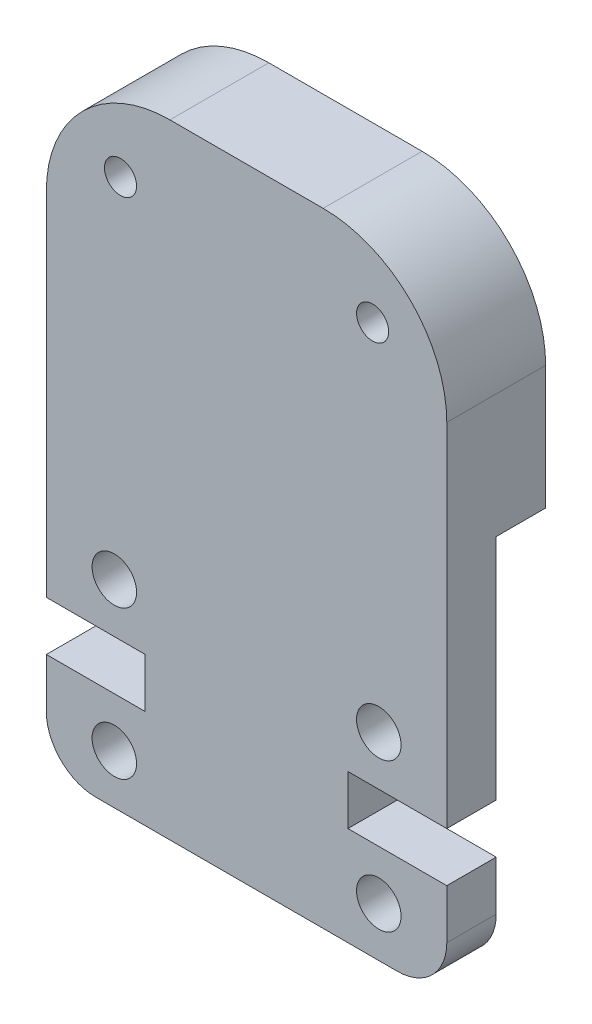
ISO-10303-21;
HEADER;
FILE_DESCRIPTION(('STEP AP214'),'2;1');
FILE_NAME('part.step','',(''),(''),'','','');
FILE_SCHEMA(('AUTOMOTIVE_DESIGN { 1 0 10303 214 1 1 1 1 }'));
ENDSEC;
DATA;
#1=APPLICATION_CONTEXT('core data for automotive mechanical design processes');
#2=APPLICATION_PROTOCOL_DEFINITION('international standard','automotive_design',2000,#1);
#3=PRODUCT_CONTEXT('',#1,'mechanical');
#4=PRODUCT('Part','Part','',(#3));
#5=PRODUCT_RELATED_PRODUCT_CATEGORY('part','',(#4));
#6=PRODUCT_DEFINITION_FORMATION('','',#4);
#7=PRODUCT_DEFINITION_CONTEXT('part definition',#1,'design');
#8=PRODUCT_DEFINITION('design','',#6,#7);
#9=PRODUCT_DEFINITION_SHAPE('','',#8);
#10=(LENGTH_UNIT() NAMED_UNIT(*) SI_UNIT(.MILLI.,.METRE.));
#11=(NAMED_UNIT(*) PLANE_ANGLE_UNIT() SI_UNIT($,.RADIAN.));
#12=(NAMED_UNIT(*) SI_UNIT($,.STERADIAN.) SOLID_ANGLE_UNIT());
#13=UNCERTAINTY_MEASURE_WITH_UNIT(LENGTH_MEASURE(1.E-05),#10,'distance_accuracy_value','');
#14=(GEOMETRIC_REPRESENTATION_CONTEXT(3) GLOBAL_UNCERTAINTY_ASSIGNED_CONTEXT((#13)) GLOBAL_UNIT_ASSIGNED_CONTEXT((#10,
#11,#12)) REPRESENTATION_CONTEXT('',''));
#15=CARTESIAN_POINT('',(0.,0.,0.));
#16=DIRECTION('',(0.,0.,1.));
#17=DIRECTION('',(1.,0.,0.));
#18=AXIS2_PLACEMENT_3D('',#15,#16,#17);
#19=CARTESIAN_POINT('',(14.2,2.00000000000002,0.));
#20=DIRECTION('',(0.,0.,-1.));
#21=DIRECTION('',(-1.,0.,0.));
#22=AXIS2_PLACEMENT_3D('',#19,#20,#21);
#23=PLANE('',#22);
#24=CARTESIAN_POINT('',(13.1999999999968,22.2299999999968,0.));
#25=DIRECTION('',(0.,0.,1.));
#26=DIRECTION('',(-1.,0.,0.));
#27=AXIS2_PLACEMENT_3D('',#24,#25,#26);
#28=CIRCLE('',#27,0.649999999999999);
#29=CARTESIAN_POINT('',(12.5499999999968,22.2299999999968,0.));
#30=VERTEX_POINT('',#29);
#31=EDGE_CURVE('E282',#30,#30,#28,.T.);
#32=ORIENTED_EDGE('',*,*,#31,.T.);
#33=EDGE_LOOP('',(#32));
#34=FACE_BOUND('',#33,.T.);
#35=CARTESIAN_POINT('',(3.00000000000323,22.2299999999968,0.));
#36=DIRECTION('',(0.,0.,1.));
#37=DIRECTION('',(1.,0.,0.));
#38=AXIS2_PLACEMENT_3D('',#35,#36,#37);
#39=CIRCLE('',#38,0.65);
#40=CARTESIAN_POINT('',(3.65000000000323,22.2299999999968,0.));
#41=VERTEX_POINT('',#40);
#42=EDGE_CURVE('E270',#41,#41,#39,.T.);
#43=ORIENTED_EDGE('',*,*,#42,.T.);
#44=EDGE_LOOP('',(#43));
#45=FACE_BOUND('',#44,.T.);
#46=DIRECTION('',(0.,1.,0.));
#47=VECTOR('',#46,1.);
#48=CARTESIAN_POINT('',(16.2,20.23,0.));
#49=LINE('',#48,#47);
#50=CARTESIAN_POINT('',(16.2,15.23,0.));
#51=VERTEX_POINT('',#50);
#52=CARTESIAN_POINT('',(16.2,20.23,0.));
#53=VERTEX_POINT('',#52);
#54=EDGE_CURVE('E159',#51,#53,#49,.T.);
#55=ORIENTED_EDGE('',*,*,#54,.F.);
#56=DIRECTION('',(-1.,0.,0.));
#57=VECTOR('',#56,1.);
#58=CARTESIAN_POINT('',(16.2,15.23,0.));
#59=LINE('',#58,#57);
#60=CARTESIAN_POINT('',(0.,15.23,0.));
#61=VERTEX_POINT('',#60);
#62=EDGE_CURVE('E231',#51,#61,#59,.T.);
#63=ORIENTED_EDGE('',*,*,#62,.T.);
#64=DIRECTION('',(0.,-1.,0.));
#65=VECTOR('',#64,1.);
#66=CARTESIAN_POINT('',(0.,20.23,0.));
#67=LINE('',#66,#65);
#68=CARTESIAN_POINT('',(0.,20.23,0.));
#69=VERTEX_POINT('',#68);
#70=EDGE_CURVE('E167',#69,#61,#67,.T.);
#71=ORIENTED_EDGE('',*,*,#70,.F.);
#72=CARTESIAN_POINT('',(5.00000000000002,20.23,0.));
#73=DIRECTION('',(0.,0.,1.));
#74=DIRECTION('',(1.,0.,0.));
#75=AXIS2_PLACEMENT_3D('',#72,#73,#74);
#76=CIRCLE('',#75,5.00000000000002);
#77=CARTESIAN_POINT('',(5.00000000000002,25.23,0.));
#78=VERTEX_POINT('',#77);
#79=EDGE_CURVE('E80',#78,#69,#76,.T.);
#80=ORIENTED_EDGE('',*,*,#79,.F.);
#81=DIRECTION('',(-1.,0.,0.));
#82=VECTOR('',#81,1.);
#83=CARTESIAN_POINT('',(5.00000000000002,25.23,0.));
#84=LINE('',#83,#82);
#85=CARTESIAN_POINT('',(11.2,25.23,0.));
#86=VERTEX_POINT('',#85);
#87=EDGE_CURVE('E164',#86,#78,#84,.T.);
#88=ORIENTED_EDGE('',*,*,#87,.F.);
#89=CARTESIAN_POINT('',(11.2,20.23,0.));
#90=DIRECTION('',(0.,0.,1.));
#91=DIRECTION('',(-1.,0.,0.));
#92=AXIS2_PLACEMENT_3D('',#89,#90,#91);
#93=CIRCLE('',#92,5.00000000000002);
#94=EDGE_CURVE('E161',#53,#86,#93,.T.);
#95=ORIENTED_EDGE('',*,*,#94,.F.);
#96=EDGE_LOOP('',(#55,#63,#71,#80,#88,#95));
#97=FACE_BOUND('',#96,.T.);
#98=ADVANCED_FACE('F33',(#34,#45,#97),#23,.T.);
#99=CARTESIAN_POINT('',(16.2,20.23,4.));
#100=DIRECTION('',(-1.,0.,0.));
#101=DIRECTION('',(0.,-1.,0.));
#102=AXIS2_PLACEMENT_3D('',#99,#100,#101);
#103=PLANE('',#102);
#104=DIRECTION('',(0.,0.,-1.));
#105=VECTOR('',#104,1.);
#106=CARTESIAN_POINT('',(16.2,15.23,2.));
#107=LINE('',#106,#105);
#108=CARTESIAN_POINT('',(16.2,15.23,2.));
#109=VERTEX_POINT('',#108);
#110=EDGE_CURVE('E236',#109,#51,#107,.T.);
#111=ORIENTED_EDGE('',*,*,#110,.T.);
#112=ORIENTED_EDGE('',*,*,#54,.T.);
#113=DIRECTION('',(0.,0.,-1.));
#114=VECTOR('',#113,1.);
#115=CARTESIAN_POINT('',(16.2,20.23,4.));
#116=LINE('',#115,#114);
#117=CARTESIAN_POINT('',(16.2,20.23,4.));
#118=VERTEX_POINT('',#117);
#119=EDGE_CURVE('E191',#118,#53,#116,.T.);
#120=ORIENTED_EDGE('',*,*,#119,.F.);
#121=DIRECTION('',(0.,1.,0.));
#122=VECTOR('',#121,1.);
#123=CARTESIAN_POINT('',(16.2,20.23,4.));
#124=LINE('',#123,#122);
#125=CARTESIAN_POINT('',(16.2,6.00000000000006,4.));
#126=VERTEX_POINT('',#125);
#127=EDGE_CURVE('E297',#126,#118,#124,.T.);
#128=ORIENTED_EDGE('',*,*,#127,.F.);
#129=DIRECTION('',(0.,0.,-1.));
#130=VECTOR('',#129,1.);
#131=CARTESIAN_POINT('',(16.2,6.00000000000006,4.));
#132=LINE('',#131,#130);
#133=CARTESIAN_POINT('',(16.2,6.00000000000006,2.));
#134=VERTEX_POINT('',#133);
#135=EDGE_CURVE('E194',#126,#134,#132,.T.);
#136=ORIENTED_EDGE('',*,*,#135,.T.);
#137=DIRECTION('',(0.,1.,0.));
#138=VECTOR('',#137,1.);
#139=CARTESIAN_POINT('',(16.2,0.,2.));
#140=LINE('',#139,#138);
#141=EDGE_CURVE('E221',#134,#109,#140,.T.);
#142=ORIENTED_EDGE('',*,*,#141,.T.);
#143=EDGE_LOOP('',(#111,#112,#120,#128,#136,#142));
#144=FACE_BOUND('',#143,.T.);
#145=ADVANCED_FACE('F379',(#144),#103,.F.);
#146=CARTESIAN_POINT('',(0.,20.23,4.));
#147=DIRECTION('',(1.,0.,0.));
#148=DIRECTION('',(0.,1.,0.));
#149=AXIS2_PLACEMENT_3D('',#146,#147,#148);
#150=PLANE('',#149);
#151=DIRECTION('',(0.,0.,-1.));
#152=VECTOR('',#151,1.);
#153=CARTESIAN_POINT('',(0.,15.23,2.));
#154=LINE('',#153,#152);
#155=CARTESIAN_POINT('',(0.,15.23,2.));
#156=VERTEX_POINT('',#155);
#157=EDGE_CURVE('E224',#156,#61,#154,.T.);
#158=ORIENTED_EDGE('',*,*,#157,.F.);
#159=DIRECTION('',(0.,-1.,0.));
#160=VECTOR('',#159,1.);
#161=CARTESIAN_POINT('',(0.,15.23,2.));
#162=LINE('',#161,#160);
#163=CARTESIAN_POINT('',(0.,6.00000000000004,2.));
#164=VERTEX_POINT('',#163);
#165=EDGE_CURVE('E356',#156,#164,#162,.T.);
#166=ORIENTED_EDGE('',*,*,#165,.T.);
#167=DIRECTION('',(0.,0.,-1.));
#168=VECTOR('',#167,1.);
#169=CARTESIAN_POINT('',(0.,6.00000000000003,4.));
#170=LINE('',#169,#168);
#171=CARTESIAN_POINT('',(0.,6.00000000000003,4.));
#172=VERTEX_POINT('',#171);
#173=EDGE_CURVE('E181',#172,#164,#170,.T.);
#174=ORIENTED_EDGE('',*,*,#173,.F.);
#175=DIRECTION('',(0.,-1.,0.));
#176=VECTOR('',#175,1.);
#177=CARTESIAN_POINT('',(0.,20.23,4.));
#178=LINE('',#177,#176);
#179=CARTESIAN_POINT('',(0.,20.23,4.));
#180=VERTEX_POINT('',#179);
#181=EDGE_CURVE('E305',#180,#172,#178,.T.);
#182=ORIENTED_EDGE('',*,*,#181,.F.);
#183=DIRECTION('',(0.,0.,-1.));
#184=VECTOR('',#183,1.);
#185=CARTESIAN_POINT('',(0.,20.23,4.));
#186=LINE('',#185,#184);
#187=EDGE_CURVE('E184',#180,#69,#186,.T.);
#188=ORIENTED_EDGE('',*,*,#187,.T.);
#189=ORIENTED_EDGE('',*,*,#70,.T.);
#190=EDGE_LOOP('',(#158,#166,#174,#182,#188,#189));
#191=FACE_BOUND('',#190,.T.);
#192=ADVANCED_FACE('F362',(#191),#150,.F.);
#193=CARTESIAN_POINT('',(14.2,2.00000000000002,4.));
#194=DIRECTION('',(0.,0.,-1.));
#195=DIRECTION('',(-1.,0.,0.));
#196=AXIS2_PLACEMENT_3D('',#193,#194,#195);
#197=PLANE('',#196);
#198=CARTESIAN_POINT('',(3.00000000000323,22.2299999999968,4.));
#199=DIRECTION('',(0.,0.,1.));
#200=DIRECTION('',(1.,0.,0.));
#201=AXIS2_PLACEMENT_3D('',#198,#199,#200);
#202=CIRCLE('',#201,0.65);
#203=CARTESIAN_POINT('',(3.65000000000323,22.2299999999968,4.));
#204=VERTEX_POINT('',#203);
#205=EDGE_CURVE('E271',#204,#204,#202,.T.);
#206=ORIENTED_EDGE('',*,*,#205,.F.);
#207=EDGE_LOOP('',(#206));
#208=FACE_BOUND('',#207,.T.);
#209=CARTESIAN_POINT('',(2.75000000000002,8.00000000000025,4.));
#210=DIRECTION('',(0.,0.,1.));
#211=DIRECTION('',(1.,0.,0.));
#212=AXIS2_PLACEMENT_3D('',#209,#210,#211);
#213=CIRCLE('',#212,0.9);
#214=CARTESIAN_POINT('',(3.65000000000002,8.00000000000025,4.));
#215=VERTEX_POINT('',#214);
#216=EDGE_CURVE('E279',#215,#215,#213,.T.);
#217=ORIENTED_EDGE('',*,*,#216,.F.);
#218=EDGE_LOOP('',(#217));
#219=FACE_BOUND('',#218,.T.);
#220=CARTESIAN_POINT('',(13.45,2.00000000000002,4.));
#221=DIRECTION('',(0.,0.,1.));
#222=DIRECTION('',(-1.,0.,0.));
#223=AXIS2_PLACEMENT_3D('',#220,#221,#222);
#224=CIRCLE('',#223,0.9);
#225=CARTESIAN_POINT('',(12.55,2.00000000000002,4.));
#226=VERTEX_POINT('',#225);
#227=EDGE_CURVE('E162',#226,#226,#224,.T.);
#228=ORIENTED_EDGE('',*,*,#227,.F.);
#229=EDGE_LOOP('',(#228));
#230=FACE_BOUND('',#229,.T.);
#231=CARTESIAN_POINT('',(14.2,2.00000000000002,4.));
#232=DIRECTION('',(0.,0.,1.));
#233=DIRECTION('',(-1.,0.,0.));
#234=AXIS2_PLACEMENT_3D('',#231,#232,#233);
#235=CIRCLE('',#234,2.00000000000002);
#236=CARTESIAN_POINT('',(14.2,0.,4.));
#237=VERTEX_POINT('',#236);
#238=CARTESIAN_POINT('',(16.2,2.00000000000002,4.));
#239=VERTEX_POINT('',#238);
#240=EDGE_CURVE('E170',#237,#239,#235,.T.);
#241=ORIENTED_EDGE('',*,*,#240,.T.);
#242=DIRECTION('',(0.,1.,0.));
#243=VECTOR('',#242,1.);
#244=CARTESIAN_POINT('',(16.2,2.00000000000002,4.));
#245=LINE('',#244,#243);
#246=CARTESIAN_POINT('',(16.2,4.00000000000001,4.));
#247=VERTEX_POINT('',#246);
#248=EDGE_CURVE('E88',#239,#247,#245,.T.);
#249=ORIENTED_EDGE('',*,*,#248,.T.);
#250=DIRECTION('',(-1.,0.,0.));
#251=VECTOR('',#250,1.);
#252=CARTESIAN_POINT('',(12.1999999999999,4.00000000000003,4.));
#253=LINE('',#252,#251);
#254=CARTESIAN_POINT('',(12.1999999999999,4.00000000000003,4.));
#255=VERTEX_POINT('',#254);
#256=EDGE_CURVE('E212',#247,#255,#253,.T.);
#257=ORIENTED_EDGE('',*,*,#256,.T.);
#258=DIRECTION('',(0.,1.,0.));
#259=VECTOR('',#258,1.);
#260=CARTESIAN_POINT('',(12.1999999999999,6.00000000000006,4.));
#261=LINE('',#260,#259);
#262=CARTESIAN_POINT('',(12.1999999999999,6.00000000000006,4.));
#263=VERTEX_POINT('',#262);
#264=EDGE_CURVE('E293',#255,#263,#261,.T.);
#265=ORIENTED_EDGE('',*,*,#264,.T.);
#266=DIRECTION('',(1.,0.,0.));
#267=VECTOR('',#266,1.);
#268=CARTESIAN_POINT('',(16.2,6.00000000000006,4.));
#269=LINE('',#268,#267);
#270=EDGE_CURVE('E295',#263,#126,#269,.T.);
#271=ORIENTED_EDGE('',*,*,#270,.T.);
#272=ORIENTED_EDGE('',*,*,#127,.T.);
#273=CARTESIAN_POINT('',(11.2,20.23,4.));
#274=DIRECTION('',(0.,0.,1.));
#275=DIRECTION('',(-1.,0.,0.));
#276=AXIS2_PLACEMENT_3D('',#273,#274,#275);
#277=CIRCLE('',#276,5.00000000000002);
#278=CARTESIAN_POINT('',(11.2,25.23,4.));
#279=VERTEX_POINT('',#278);
#280=EDGE_CURVE('E299',#118,#279,#277,.T.);
#281=ORIENTED_EDGE('',*,*,#280,.T.);
#282=DIRECTION('',(-1.,0.,0.));
#283=VECTOR('',#282,1.);
#284=CARTESIAN_POINT('',(5.00000000000002,25.23,4.));
#285=LINE('',#284,#283);
#286=CARTESIAN_POINT('',(5.00000000000002,25.23,4.));
#287=VERTEX_POINT('',#286);
#288=EDGE_CURVE('E301',#279,#287,#285,.T.);
#289=ORIENTED_EDGE('',*,*,#288,.T.);
#290=CARTESIAN_POINT('',(5.00000000000002,20.23,4.));
#291=DIRECTION('',(0.,0.,1.));
#292=DIRECTION('',(1.,0.,0.));
#293=AXIS2_PLACEMENT_3D('',#290,#291,#292);
#294=CIRCLE('',#293,5.00000000000002);
#295=EDGE_CURVE('E303',#287,#180,#294,.T.);
#296=ORIENTED_EDGE('',*,*,#295,.T.);
#297=ORIENTED_EDGE('',*,*,#181,.T.);
#298=DIRECTION('',(1.,0.,0.));
#299=VECTOR('',#298,1.);
#300=CARTESIAN_POINT('',(0.,6.00000000000003,4.));
#301=LINE('',#300,#299);
#302=CARTESIAN_POINT('',(4.00000000000004,6.00000000000003,4.));
#303=VERTEX_POINT('',#302);
#304=EDGE_CURVE('E307',#172,#303,#301,.T.);
#305=ORIENTED_EDGE('',*,*,#304,.T.);
#306=DIRECTION('',(0.,-1.,0.));
#307=VECTOR('',#306,1.);
#308=CARTESIAN_POINT('',(4.00000000000004,6.00000000000003,4.));
#309=LINE('',#308,#307);
#310=CARTESIAN_POINT('',(4.00000000000004,4.00000000000002,4.));
#311=VERTEX_POINT('',#310);
#312=EDGE_CURVE('E309',#303,#311,#309,.T.);
#313=ORIENTED_EDGE('',*,*,#312,.T.);
#314=DIRECTION('',(-1.,0.,0.));
#315=VECTOR('',#314,1.);
#316=CARTESIAN_POINT('',(4.00000000000004,4.00000000000002,4.));
#317=LINE('',#316,#315);
#318=CARTESIAN_POINT('',(0.,4.,4.));
#319=VERTEX_POINT('',#318);
#320=EDGE_CURVE('E135',#311,#319,#317,.T.);
#321=ORIENTED_EDGE('',*,*,#320,.T.);
#322=DIRECTION('',(0.,-1.,0.));
#323=VECTOR('',#322,1.);
#324=CARTESIAN_POINT('',(0.,2.00000000000003,4.));
#325=LINE('',#324,#323);
#326=CARTESIAN_POINT('',(0.,2.00000000000003,4.));
#327=VERTEX_POINT('',#326);
#328=EDGE_CURVE('E127',#319,#327,#325,.T.);
#329=ORIENTED_EDGE('',*,*,#328,.T.);
#330=CARTESIAN_POINT('',(2.00000000000001,2.00000000000003,4.));
#331=DIRECTION('',(0.,0.,1.));
#332=DIRECTION('',(1.,0.,0.));
#333=AXIS2_PLACEMENT_3D('',#330,#331,#332);
#334=CIRCLE('',#333,2.00000000000001);
#335=CARTESIAN_POINT('',(2.00000000000001,0.,4.));
#336=VERTEX_POINT('',#335);
#337=EDGE_CURVE('E132',#327,#336,#334,.T.);
#338=ORIENTED_EDGE('',*,*,#337,.T.);
#339=DIRECTION('',(1.,0.,0.));
#340=VECTOR('',#339,1.);
#341=CARTESIAN_POINT('',(2.00000000000001,0.,4.));
#342=LINE('',#341,#340);
#343=EDGE_CURVE('E58',#336,#237,#342,.T.);
#344=ORIENTED_EDGE('',*,*,#343,.T.);
#345=EDGE_LOOP('',(#241,#249,#257,#265,#271,#272,#281,#289,#296,#297,#305,#313,#321,#329,#338,#344));
#346=FACE_BOUND('',#345,.T.);
#347=CARTESIAN_POINT('',(13.1999999999968,22.2299999999968,4.));
#348=DIRECTION('',(0.,0.,1.));
#349=DIRECTION('',(-1.,0.,0.));
#350=AXIS2_PLACEMENT_3D('',#347,#348,#349);
#351=CIRCLE('',#350,0.649999999999999);
#352=CARTESIAN_POINT('',(12.5499999999968,22.2299999999968,4.));
#353=VERTEX_POINT('',#352);
#354=EDGE_CURVE('E283',#353,#353,#351,.T.);
#355=ORIENTED_EDGE('',*,*,#354,.F.);
#356=EDGE_LOOP('',(#355));
#357=FACE_BOUND('',#356,.T.);
#358=CARTESIAN_POINT('',(13.45,8.00000000000002,4.));
#359=DIRECTION('',(0.,0.,1.));
#360=DIRECTION('',(-1.,0.,0.));
#361=AXIS2_PLACEMENT_3D('',#358,#359,#360);
#362=CIRCLE('',#361,0.9);
#363=CARTESIAN_POINT('',(12.55,8.00000000000002,4.));
#364=VERTEX_POINT('',#363);
#365=EDGE_CURVE('E274',#364,#364,#362,.T.);
#366=ORIENTED_EDGE('',*,*,#365,.F.);
#367=EDGE_LOOP('',(#366));
#368=FACE_BOUND('',#367,.T.);
#369=CARTESIAN_POINT('',(2.75000000000002,2.00000000000025,4.));
#370=DIRECTION('',(0.,0.,1.));
#371=DIRECTION('',(1.,0.,0.));
#372=AXIS2_PLACEMENT_3D('',#369,#370,#371);
#373=CIRCLE('',#372,0.9);
#374=CARTESIAN_POINT('',(3.65000000000002,2.00000000000025,4.));
#375=VERTEX_POINT('',#374);
#376=EDGE_CURVE('E267',#375,#375,#373,.T.);
#377=ORIENTED_EDGE('',*,*,#376,.F.);
#378=EDGE_LOOP('',(#377));
#379=FACE_BOUND('',#378,.T.);
#380=ADVANCED_FACE('F129',(#208,#219,#230,#346,#357,#368,#379),#197,.F.);
#381=CARTESIAN_POINT('',(14.2,2.00000000000002,4.));
#382=DIRECTION('',(0.,0.,-1.));
#383=DIRECTION('',(-1.,0.,0.));
#384=AXIS2_PLACEMENT_3D('',#381,#382,#383);
#385=CYLINDRICAL_SURFACE('',#384,2.00000000000002);
#386=DIRECTION('',(0.,0.,-1.));
#387=VECTOR('',#386,1.);
#388=CARTESIAN_POINT('',(14.2,0.,4.));
#389=LINE('',#388,#387);
#390=CARTESIAN_POINT('',(14.2,0.,2.));
#391=VERTEX_POINT('',#390);
#392=EDGE_CURVE('E155',#237,#391,#389,.T.);
#393=ORIENTED_EDGE('',*,*,#392,.T.);
#394=CARTESIAN_POINT('',(14.2,2.00000000000002,2.));
#395=DIRECTION('',(0.,0.,1.));
#396=DIRECTION('',(1.,0.,0.));
#397=AXIS2_PLACEMENT_3D('',#394,#395,#396);
#398=CIRCLE('',#397,2.00000000000002);
#399=CARTESIAN_POINT('',(16.2,2.00000000000002,2.));
#400=VERTEX_POINT('',#399);
#401=EDGE_CURVE('E49',#391,#400,#398,.T.);
#402=ORIENTED_EDGE('',*,*,#401,.T.);
#403=DIRECTION('',(0.,0.,-1.));
#404=VECTOR('',#403,1.);
#405=CARTESIAN_POINT('',(16.2,2.00000000000002,4.));
#406=LINE('',#405,#404);
#407=EDGE_CURVE('E11',#239,#400,#406,.T.);
#408=ORIENTED_EDGE('',*,*,#407,.F.);
#409=ORIENTED_EDGE('',*,*,#240,.F.);
#410=EDGE_LOOP('',(#393,#402,#408,#409));
#411=FACE_BOUND('',#410,.T.);
#412=ADVANCED_FACE('F35',(#411),#385,.T.);
#413=CARTESIAN_POINT('',(16.2,2.00000000000002,4.));
#414=DIRECTION('',(-1.,0.,0.));
#415=DIRECTION('',(0.,-1.,0.));
#416=AXIS2_PLACEMENT_3D('',#413,#414,#415);
#417=PLANE('',#416);
#418=ORIENTED_EDGE('',*,*,#407,.T.);
#419=CARTESIAN_POINT('',(16.2,4.00000000000002,2.));
#420=VERTEX_POINT('',#419);
#421=EDGE_CURVE('E218',#400,#420,#140,.T.);
#422=ORIENTED_EDGE('',*,*,#421,.T.);
#423=DIRECTION('',(0.,0.,-1.));
#424=VECTOR('',#423,1.);
#425=CARTESIAN_POINT('',(16.2,4.00000000000001,4.));
#426=LINE('',#425,#424);
#427=EDGE_CURVE('E42',#247,#420,#426,.T.);
#428=ORIENTED_EDGE('',*,*,#427,.F.);
#429=ORIENTED_EDGE('',*,*,#248,.F.);
#430=EDGE_LOOP('',(#418,#422,#428,#429));
#431=FACE_BOUND('',#430,.T.);
#432=ADVANCED_FACE('F217',(#431),#417,.F.);
#433=CARTESIAN_POINT('',(12.1999999999999,4.00000000000003,4.));
#434=DIRECTION('',(0.,-1.,0.));
#435=DIRECTION('',(1.,0.,0.));
#436=AXIS2_PLACEMENT_3D('',#433,#434,#435);
#437=PLANE('',#436);
#438=ORIENTED_EDGE('',*,*,#427,.T.);
#439=DIRECTION('',(-1.,0.,0.));
#440=VECTOR('',#439,1.);
#441=CARTESIAN_POINT('',(12.1999999999999,4.00000000000003,2.));
#442=LINE('',#441,#440);
#443=CARTESIAN_POINT('',(12.1999999999999,4.00000000000003,2.));
#444=VERTEX_POINT('',#443);
#445=EDGE_CURVE('E211',#420,#444,#442,.T.);
#446=ORIENTED_EDGE('',*,*,#445,.T.);
#447=DIRECTION('',(0.,0.,-1.));
#448=VECTOR('',#447,1.);
#449=CARTESIAN_POINT('',(12.1999999999999,4.00000000000003,4.));
#450=LINE('',#449,#448);
#451=EDGE_CURVE('E200',#255,#444,#450,.T.);
#452=ORIENTED_EDGE('',*,*,#451,.F.);
#453=ORIENTED_EDGE('',*,*,#256,.F.);
#454=EDGE_LOOP('',(#438,#446,#452,#453));
#455=FACE_BOUND('',#454,.T.);
#456=ADVANCED_FACE('F208',(#455),#437,.F.);
#457=CARTESIAN_POINT('',(12.1999999999999,6.00000000000006,4.));
#458=DIRECTION('',(-1.,0.,0.));
#459=DIRECTION('',(0.,0.,1.));
#460=AXIS2_PLACEMENT_3D('',#457,#458,#459);
#461=PLANE('',#460);
#462=ORIENTED_EDGE('',*,*,#451,.T.);
#463=DIRECTION('',(0.,1.,0.));
#464=VECTOR('',#463,1.);
#465=CARTESIAN_POINT('',(12.1999999999999,6.00000000000006,2.));
#466=LINE('',#465,#464);
#467=CARTESIAN_POINT('',(12.1999999999999,6.00000000000006,2.));
#468=VERTEX_POINT('',#467);
#469=EDGE_CURVE('E262',#444,#468,#466,.T.);
#470=ORIENTED_EDGE('',*,*,#469,.T.);
#471=DIRECTION('',(0.,0.,-1.));
#472=VECTOR('',#471,1.);
#473=CARTESIAN_POINT('',(12.1999999999999,6.00000000000006,4.));
#474=LINE('',#473,#472);
#475=EDGE_CURVE('E197',#263,#468,#474,.T.);
#476=ORIENTED_EDGE('',*,*,#475,.F.);
#477=ORIENTED_EDGE('',*,*,#264,.F.);
#478=EDGE_LOOP('',(#462,#470,#476,#477));
#479=FACE_BOUND('',#478,.T.);
#480=ADVANCED_FACE('F344',(#479),#461,.F.);
#481=CARTESIAN_POINT('',(16.2,6.00000000000006,4.));
#482=DIRECTION('',(0.,1.,0.));
#483=DIRECTION('',(-1.,0.,0.));
#484=AXIS2_PLACEMENT_3D('',#481,#482,#483);
#485=PLANE('',#484);
#486=ORIENTED_EDGE('',*,*,#475,.T.);
#487=DIRECTION('',(1.,0.,0.));
#488=VECTOR('',#487,1.);
#489=CARTESIAN_POINT('',(16.2,6.00000000000006,2.));
#490=LINE('',#489,#488);
#491=EDGE_CURVE('E259',#468,#134,#490,.T.);
#492=ORIENTED_EDGE('',*,*,#491,.T.);
#493=ORIENTED_EDGE('',*,*,#135,.F.);
#494=ORIENTED_EDGE('',*,*,#270,.F.);
#495=EDGE_LOOP('',(#486,#492,#493,#494));
#496=FACE_BOUND('',#495,.T.);
#497=ADVANCED_FACE('F348',(#496),#485,.F.);
#498=CARTESIAN_POINT('',(11.2,20.23,4.));
#499=DIRECTION('',(0.,0.,-1.));
#500=DIRECTION('',(-1.,0.,0.));
#501=AXIS2_PLACEMENT_3D('',#498,#499,#500);
#502=CYLINDRICAL_SURFACE('',#501,5.00000000000002);
#503=ORIENTED_EDGE('',*,*,#94,.T.);
#504=DIRECTION('',(0.,0.,-1.));
#505=VECTOR('',#504,1.);
#506=CARTESIAN_POINT('',(11.2,25.23,4.));
#507=LINE('',#506,#505);
#508=EDGE_CURVE('E188',#279,#86,#507,.T.);
#509=ORIENTED_EDGE('',*,*,#508,.F.);
#510=ORIENTED_EDGE('',*,*,#280,.F.);
#511=ORIENTED_EDGE('',*,*,#119,.T.);
#512=EDGE_LOOP('',(#503,#509,#510,#511));
#513=FACE_BOUND('',#512,.T.);
#514=ADVANCED_FACE('F538',(#513),#502,.T.);
#515=CARTESIAN_POINT('',(5.00000000000002,25.23,4.));
#516=DIRECTION('',(0.,-1.,0.));
#517=DIRECTION('',(0.,0.,-1.));
#518=AXIS2_PLACEMENT_3D('',#515,#516,#517);
#519=PLANE('',#518);
#520=ORIENTED_EDGE('',*,*,#87,.T.);
#521=DIRECTION('',(0.,0.,-1.));
#522=VECTOR('',#521,1.);
#523=CARTESIAN_POINT('',(5.00000000000002,25.23,4.));
#524=LINE('',#523,#522);
#525=EDGE_CURVE('E186',#287,#78,#524,.T.);
#526=ORIENTED_EDGE('',*,*,#525,.F.);
#527=ORIENTED_EDGE('',*,*,#288,.F.);
#528=ORIENTED_EDGE('',*,*,#508,.T.);
#529=EDGE_LOOP('',(#520,#526,#527,#528));
#530=FACE_BOUND('',#529,.T.);
#531=ADVANCED_FACE('F375',(#530),#519,.F.);
#532=CARTESIAN_POINT('',(5.00000000000002,20.23,4.));
#533=DIRECTION('',(0.,0.,-1.));
#534=DIRECTION('',(-1.,0.,0.));
#535=AXIS2_PLACEMENT_3D('',#532,#533,#534);
#536=CYLINDRICAL_SURFACE('',#535,5.00000000000002);
#537=ORIENTED_EDGE('',*,*,#79,.T.);
#538=ORIENTED_EDGE('',*,*,#187,.F.);
#539=ORIENTED_EDGE('',*,*,#295,.F.);
#540=ORIENTED_EDGE('',*,*,#525,.T.);
#541=EDGE_LOOP('',(#537,#538,#539,#540));
#542=FACE_BOUND('',#541,.T.);
#543=ADVANCED_FACE('F368',(#542),#536,.T.);
#544=CARTESIAN_POINT('',(0.,6.00000000000003,4.));
#545=DIRECTION('',(0.,1.,0.));
#546=DIRECTION('',(0.,0.,1.));
#547=AXIS2_PLACEMENT_3D('',#544,#545,#546);
#548=PLANE('',#547);
#549=ORIENTED_EDGE('',*,*,#173,.T.);
#550=DIRECTION('',(1.,0.,0.));
#551=VECTOR('',#550,1.);
#552=CARTESIAN_POINT('',(0.,6.00000000000003,2.));
#553=LINE('',#552,#551);
#554=CARTESIAN_POINT('',(4.00000000000004,6.00000000000003,2.));
#555=VERTEX_POINT('',#554);
#556=EDGE_CURVE('E256',#164,#555,#553,.T.);
#557=ORIENTED_EDGE('',*,*,#556,.T.);
#558=DIRECTION('',(0.,0.,-1.));
#559=VECTOR('',#558,1.);
#560=CARTESIAN_POINT('',(4.00000000000004,6.00000000000003,4.));
#561=LINE('',#560,#559);
#562=EDGE_CURVE('E178',#303,#555,#561,.T.);
#563=ORIENTED_EDGE('',*,*,#562,.F.);
#564=ORIENTED_EDGE('',*,*,#304,.F.);
#565=EDGE_LOOP('',(#549,#557,#563,#564));
#566=FACE_BOUND('',#565,.T.);
#567=ADVANCED_FACE('F366',(#566),#548,.F.);
#568=CARTESIAN_POINT('',(4.00000000000004,6.00000000000003,4.));
#569=DIRECTION('',(1.,0.,0.));
#570=DIRECTION('',(0.,0.,-1.));
#571=AXIS2_PLACEMENT_3D('',#568,#569,#570);
#572=PLANE('',#571);
#573=ORIENTED_EDGE('',*,*,#562,.T.);
#574=DIRECTION('',(0.,-1.,0.));
#575=VECTOR('',#574,1.);
#576=CARTESIAN_POINT('',(4.00000000000004,6.00000000000003,2.));
#577=LINE('',#576,#575);
#578=CARTESIAN_POINT('',(4.00000000000004,4.00000000000002,2.));
#579=VERTEX_POINT('',#578);
#580=EDGE_CURVE('E253',#555,#579,#577,.T.);
#581=ORIENTED_EDGE('',*,*,#580,.T.);
#582=DIRECTION('',(0.,0.,-1.));
#583=VECTOR('',#582,1.);
#584=CARTESIAN_POINT('',(4.00000000000004,4.00000000000002,4.));
#585=LINE('',#584,#583);
#586=EDGE_CURVE('E175',#311,#579,#585,.T.);
#587=ORIENTED_EDGE('',*,*,#586,.F.);
#588=ORIENTED_EDGE('',*,*,#312,.F.);
#589=EDGE_LOOP('',(#573,#581,#587,#588));
#590=FACE_BOUND('',#589,.T.);
#591=ADVANCED_FACE('F315',(#590),#572,.F.);
#592=CARTESIAN_POINT('',(4.00000000000004,4.00000000000002,4.));
#593=DIRECTION('',(0.,-1.,0.));
#594=DIRECTION('',(1.,0.,0.));
#595=AXIS2_PLACEMENT_3D('',#592,#593,#594);
#596=PLANE('',#595);
#597=ORIENTED_EDGE('',*,*,#586,.T.);
#598=DIRECTION('',(-1.,0.,0.));
#599=VECTOR('',#598,1.);
#600=CARTESIAN_POINT('',(4.00000000000004,4.00000000000002,2.));
#601=LINE('',#600,#599);
#602=CARTESIAN_POINT('',(0.,4.00000000000001,2.));
#603=VERTEX_POINT('',#602);
#604=EDGE_CURVE('E250',#579,#603,#601,.T.);
#605=ORIENTED_EDGE('',*,*,#604,.T.);
#606=DIRECTION('',(0.,0.,-1.));
#607=VECTOR('',#606,1.);
#608=CARTESIAN_POINT('',(0.,4.,4.));
#609=LINE('',#608,#607);
#610=EDGE_CURVE('E149',#319,#603,#609,.T.);
#611=ORIENTED_EDGE('',*,*,#610,.F.);
#612=ORIENTED_EDGE('',*,*,#320,.F.);
#613=EDGE_LOOP('',(#597,#605,#611,#612));
#614=FACE_BOUND('',#613,.T.);
#615=ADVANCED_FACE('F319',(#614),#596,.F.);
#616=CARTESIAN_POINT('',(0.,2.00000000000003,4.));
#617=DIRECTION('',(1.,0.,0.));
#618=DIRECTION('',(0.,0.,-1.));
#619=AXIS2_PLACEMENT_3D('',#616,#617,#618);
#620=PLANE('',#619);
#621=ORIENTED_EDGE('',*,*,#610,.T.);
#622=CARTESIAN_POINT('',(0.,2.00000000000003,2.));
#623=VERTEX_POINT('',#622);
#624=EDGE_CURVE('E146',#603,#623,#162,.T.);
#625=ORIENTED_EDGE('',*,*,#624,.T.);
#626=DIRECTION('',(0.,0.,-1.));
#627=VECTOR('',#626,1.);
#628=CARTESIAN_POINT('',(0.,2.00000000000003,4.));
#629=LINE('',#628,#627);
#630=EDGE_CURVE('E142',#327,#623,#629,.T.);
#631=ORIENTED_EDGE('',*,*,#630,.F.);
#632=ORIENTED_EDGE('',*,*,#328,.F.);
#633=EDGE_LOOP('',(#621,#625,#631,#632));
#634=FACE_BOUND('',#633,.T.);
#635=ADVANCED_FACE('F143',(#634),#620,.F.);
#636=CARTESIAN_POINT('',(2.00000000000001,2.00000000000003,4.));
#637=DIRECTION('',(0.,0.,-1.));
#638=DIRECTION('',(-1.,0.,0.));
#639=AXIS2_PLACEMENT_3D('',#636,#637,#638);
#640=CYLINDRICAL_SURFACE('',#639,2.00000000000001);
#641=ORIENTED_EDGE('',*,*,#630,.T.);
#642=CARTESIAN_POINT('',(2.00000000000001,2.00000000000003,2.));
#643=DIRECTION('',(0.,0.,1.));
#644=DIRECTION('',(1.,0.,0.));
#645=AXIS2_PLACEMENT_3D('',#642,#643,#644);
#646=CIRCLE('',#645,2.00000000000001);
#647=CARTESIAN_POINT('',(2.00000000000001,0.,2.));
#648=VERTEX_POINT('',#647);
#649=EDGE_CURVE('E248',#623,#648,#646,.T.);
#650=ORIENTED_EDGE('',*,*,#649,.T.);
#651=DIRECTION('',(0.,0.,-1.));
#652=VECTOR('',#651,1.);
#653=CARTESIAN_POINT('',(2.00000000000001,0.,4.));
#654=LINE('',#653,#652);
#655=EDGE_CURVE('E150',#336,#648,#654,.T.);
#656=ORIENTED_EDGE('',*,*,#655,.F.);
#657=ORIENTED_EDGE('',*,*,#337,.F.);
#658=EDGE_LOOP('',(#641,#650,#656,#657));
#659=FACE_BOUND('',#658,.T.);
#660=ADVANCED_FACE('F152',(#659),#640,.T.);
#661=CARTESIAN_POINT('',(2.00000000000001,0.,4.));
#662=DIRECTION('',(0.,1.,0.));
#663=DIRECTION('',(-1.,0.,0.));
#664=AXIS2_PLACEMENT_3D('',#661,#662,#663);
#665=PLANE('',#664);
#666=ORIENTED_EDGE('',*,*,#655,.T.);
#667=DIRECTION('',(1.,0.,0.));
#668=VECTOR('',#667,1.);
#669=CARTESIAN_POINT('',(0.,0.,2.));
#670=LINE('',#669,#668);
#671=EDGE_CURVE('E227',#648,#391,#670,.T.);
#672=ORIENTED_EDGE('',*,*,#671,.T.);
#673=ORIENTED_EDGE('',*,*,#392,.F.);
#674=ORIENTED_EDGE('',*,*,#343,.F.);
#675=EDGE_LOOP('',(#666,#672,#673,#674));
#676=FACE_BOUND('',#675,.T.);
#677=ADVANCED_FACE('F355',(#676),#665,.F.);
#678=CARTESIAN_POINT('',(13.45,2.00000000000002,4.));
#679=DIRECTION('',(0.,0.,-1.));
#680=DIRECTION('',(-1.,0.,0.));
#681=AXIS2_PLACEMENT_3D('',#678,#679,#680);
#682=CYLINDRICAL_SURFACE('',#681,0.9);
#683=CARTESIAN_POINT('',(13.45,2.00000000000002,2.));
#684=DIRECTION('',(0.,0.,1.));
#685=DIRECTION('',(1.,0.,0.));
#686=AXIS2_PLACEMENT_3D('',#683,#684,#685);
#687=CIRCLE('',#686,0.9);
#688=CARTESIAN_POINT('',(14.35,2.00000000000002,2.));
#689=VERTEX_POINT('',#688);
#690=EDGE_CURVE('E245',#689,#689,#687,.T.);
#691=ORIENTED_EDGE('',*,*,#690,.F.);
#692=EDGE_LOOP('',(#691));
#693=FACE_BOUND('',#692,.T.);
#694=ORIENTED_EDGE('',*,*,#227,.T.);
#695=EDGE_LOOP('',(#694));
#696=FACE_BOUND('',#695,.T.);
#697=ADVANCED_FACE('F393',(#693,#696),#682,.F.);
#698=CARTESIAN_POINT('',(13.1999999999968,22.2299999999968,4.));
#699=DIRECTION('',(0.,0.,-1.));
#700=DIRECTION('',(-1.,0.,0.));
#701=AXIS2_PLACEMENT_3D('',#698,#699,#700);
#702=CYLINDRICAL_SURFACE('',#701,0.649999999999999);
#703=ORIENTED_EDGE('',*,*,#354,.T.);
#704=EDGE_LOOP('',(#703));
#705=FACE_BOUND('',#704,.T.);
#706=ORIENTED_EDGE('',*,*,#31,.F.);
#707=EDGE_LOOP('',(#706));
#708=FACE_BOUND('',#707,.T.);
#709=ADVANCED_FACE('F421',(#705,#708),#702,.F.);
#710=CARTESIAN_POINT('',(2.75000000000002,8.00000000000025,4.));
#711=DIRECTION('',(0.,0.,-1.));
#712=DIRECTION('',(-1.,0.,0.));
#713=AXIS2_PLACEMENT_3D('',#710,#711,#712);
#714=CYLINDRICAL_SURFACE('',#713,0.9);
#715=CARTESIAN_POINT('',(2.75000000000002,8.00000000000025,2.));
#716=DIRECTION('',(0.,0.,1.));
#717=DIRECTION('',(1.,0.,0.));
#718=AXIS2_PLACEMENT_3D('',#715,#716,#717);
#719=CIRCLE('',#718,0.9);
#720=CARTESIAN_POINT('',(3.65000000000002,8.00000000000025,2.));
#721=VERTEX_POINT('',#720);
#722=EDGE_CURVE('E242',#721,#721,#719,.T.);
#723=ORIENTED_EDGE('',*,*,#722,.F.);
#724=EDGE_LOOP('',(#723));
#725=FACE_BOUND('',#724,.T.);
#726=ORIENTED_EDGE('',*,*,#216,.T.);
#727=EDGE_LOOP('',(#726));
#728=FACE_BOUND('',#727,.T.);
#729=ADVANCED_FACE('F429',(#725,#728),#714,.F.);
#730=CARTESIAN_POINT('',(13.45,8.00000000000002,4.));
#731=DIRECTION('',(0.,0.,-1.));
#732=DIRECTION('',(-1.,0.,0.));
#733=AXIS2_PLACEMENT_3D('',#730,#731,#732);
#734=CYLINDRICAL_SURFACE('',#733,0.9);
#735=CARTESIAN_POINT('',(13.45,8.00000000000002,2.));
#736=DIRECTION('',(0.,0.,1.));
#737=DIRECTION('',(1.,0.,0.));
#738=AXIS2_PLACEMENT_3D('',#735,#736,#737);
#739=CIRCLE('',#738,0.9);
#740=CARTESIAN_POINT('',(14.35,8.00000000000002,2.));
#741=VERTEX_POINT('',#740);
#742=EDGE_CURVE('E239',#741,#741,#739,.T.);
#743=ORIENTED_EDGE('',*,*,#742,.F.);
#744=EDGE_LOOP('',(#743));
#745=FACE_BOUND('',#744,.T.);
#746=ORIENTED_EDGE('',*,*,#365,.T.);
#747=EDGE_LOOP('',(#746));
#748=FACE_BOUND('',#747,.T.);
#749=ADVANCED_FACE('F438',(#745,#748),#734,.F.);
#750=CARTESIAN_POINT('',(3.00000000000323,22.2299999999968,4.));
#751=DIRECTION('',(0.,0.,-1.));
#752=DIRECTION('',(-1.,0.,0.));
#753=AXIS2_PLACEMENT_3D('',#750,#751,#752);
#754=CYLINDRICAL_SURFACE('',#753,0.65);
#755=ORIENTED_EDGE('',*,*,#205,.T.);
#756=EDGE_LOOP('',(#755));
#757=FACE_BOUND('',#756,.T.);
#758=ORIENTED_EDGE('',*,*,#42,.F.);
#759=EDGE_LOOP('',(#758));
#760=FACE_BOUND('',#759,.T.);
#761=ADVANCED_FACE('F446',(#757,#760),#754,.F.);
#762=CARTESIAN_POINT('',(2.75000000000002,2.00000000000025,4.));
#763=DIRECTION('',(0.,0.,-1.));
#764=DIRECTION('',(-1.,0.,0.));
#765=AXIS2_PLACEMENT_3D('',#762,#763,#764);
#766=CYLINDRICAL_SURFACE('',#765,0.9);
#767=CARTESIAN_POINT('',(2.75000000000002,2.00000000000025,2.));
#768=DIRECTION('',(0.,0.,1.));
#769=DIRECTION('',(1.,0.,0.));
#770=AXIS2_PLACEMENT_3D('',#767,#768,#769);
#771=CIRCLE('',#770,0.9);
#772=CARTESIAN_POINT('',(3.65000000000002,2.00000000000025,2.));
#773=VERTEX_POINT('',#772);
#774=EDGE_CURVE('E37',#773,#773,#771,.T.);
#775=ORIENTED_EDGE('',*,*,#774,.F.);
#776=EDGE_LOOP('',(#775));
#777=FACE_BOUND('',#776,.T.);
#778=ORIENTED_EDGE('',*,*,#376,.T.);
#779=EDGE_LOOP('',(#778));
#780=FACE_BOUND('',#779,.T.);
#781=ADVANCED_FACE('F454',(#777,#780),#766,.F.);
#782=CARTESIAN_POINT('',(0.,0.,2.));
#783=DIRECTION('',(0.,0.,1.));
#784=DIRECTION('',(1.,0.,0.));
#785=AXIS2_PLACEMENT_3D('',#782,#783,#784);
#786=PLANE('',#785);
#787=ORIENTED_EDGE('',*,*,#690,.T.);
#788=EDGE_LOOP('',(#787));
#789=FACE_BOUND('',#788,.T.);
#790=ORIENTED_EDGE('',*,*,#722,.T.);
#791=EDGE_LOOP('',(#790));
#792=FACE_BOUND('',#791,.T.);
#793=ORIENTED_EDGE('',*,*,#742,.T.);
#794=EDGE_LOOP('',(#793));
#795=FACE_BOUND('',#794,.T.);
#796=ORIENTED_EDGE('',*,*,#774,.T.);
#797=EDGE_LOOP('',(#796));
#798=FACE_BOUND('',#797,.T.);
#799=ORIENTED_EDGE('',*,*,#671,.F.);
#800=ORIENTED_EDGE('',*,*,#649,.F.);
#801=ORIENTED_EDGE('',*,*,#624,.F.);
#802=ORIENTED_EDGE('',*,*,#604,.F.);
#803=ORIENTED_EDGE('',*,*,#580,.F.);
#804=ORIENTED_EDGE('',*,*,#556,.F.);
#805=ORIENTED_EDGE('',*,*,#165,.F.);
#806=DIRECTION('',(-1.,0.,0.));
#807=VECTOR('',#806,1.);
#808=CARTESIAN_POINT('',(16.2,15.23,2.));
#809=LINE('',#808,#807);
#810=EDGE_CURVE('E220',#109,#156,#809,.T.);
#811=ORIENTED_EDGE('',*,*,#810,.F.);
#812=ORIENTED_EDGE('',*,*,#141,.F.);
#813=ORIENTED_EDGE('',*,*,#491,.F.);
#814=ORIENTED_EDGE('',*,*,#469,.F.);
#815=ORIENTED_EDGE('',*,*,#445,.F.);
#816=ORIENTED_EDGE('',*,*,#421,.F.);
#817=ORIENTED_EDGE('',*,*,#401,.F.);
#818=EDGE_LOOP('',(#799,#800,#801,#802,#803,#804,#805,#811,#812,#813,#814,#815,#816,#817));
#819=FACE_BOUND('',#818,.T.);
#820=ADVANCED_FACE('F341',(#789,#792,#795,#798,#819),#786,.F.);
#821=CARTESIAN_POINT('',(16.2,15.23,2.));
#822=DIRECTION('',(0.,-1.,0.));
#823=DIRECTION('',(1.,0.,0.));
#824=AXIS2_PLACEMENT_3D('',#821,#822,#823);
#825=PLANE('',#824);
#826=ORIENTED_EDGE('',*,*,#62,.F.);
#827=ORIENTED_EDGE('',*,*,#110,.F.);
#828=ORIENTED_EDGE('',*,*,#810,.T.);
#829=ORIENTED_EDGE('',*,*,#157,.T.);
#830=EDGE_LOOP('',(#826,#827,#828,#829));
#831=FACE_BOUND('',#830,.T.);
#832=ADVANCED_FACE('F468',(#831),#825,.T.);
#833=CLOSED_SHELL('',(#98,#145,#192,#380,#412,#432,#456,#480,#497,#514,#531,#543,#567,#591,#615,
#635,#660,#677,#697,#709,#729,#749,#761,#781,#820,#832));
#834=MANIFOLD_SOLID_BREP('B2',#833);
#835=ADVANCED_BREP_SHAPE_REPRESENTATION('',(#18,#834),#14);
#836=SHAPE_DEFINITION_REPRESENTATION(#9,#835);
ENDSEC;
END-ISO-10303-21;
